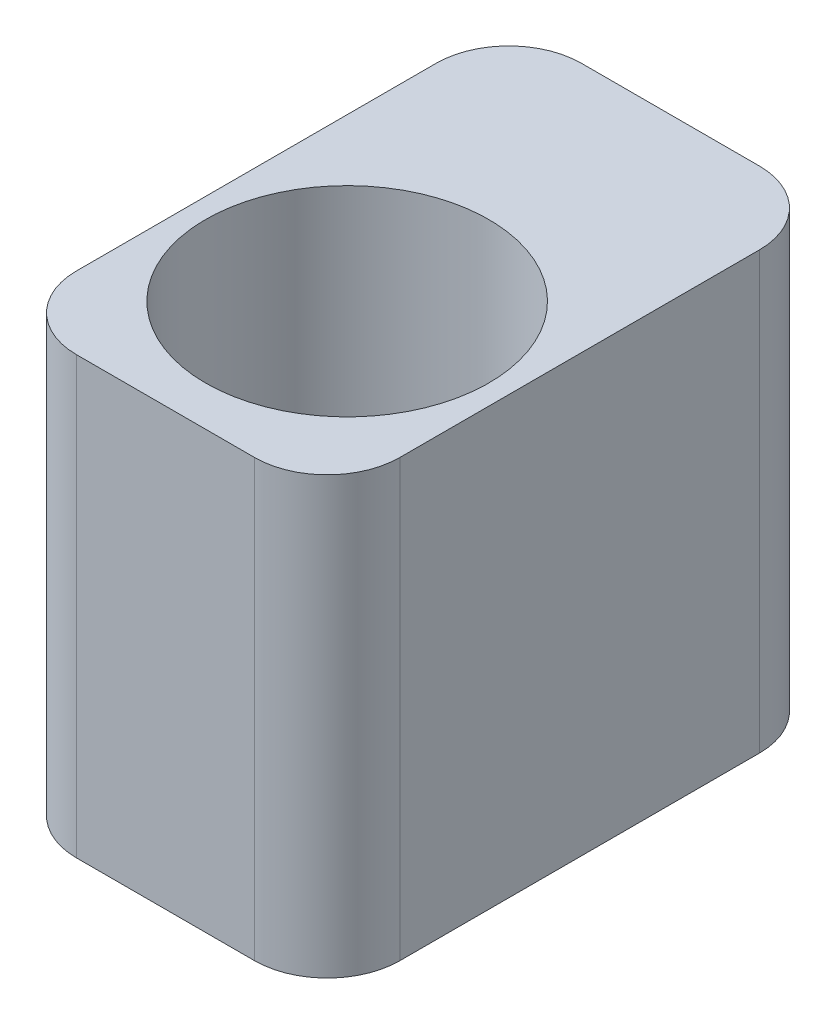
ISO-10303-21;
HEADER;
FILE_DESCRIPTION(('STEP AP214'),'2;1');
FILE_NAME('part.step','',(''),(''),'','','');
FILE_SCHEMA(('AUTOMOTIVE_DESIGN { 1 0 10303 214 1 1 1 1 }'));
ENDSEC;
DATA;
#1=APPLICATION_CONTEXT('core data for automotive mechanical design processes');
#2=APPLICATION_PROTOCOL_DEFINITION('international standard','automotive_design',2000,#1);
#3=PRODUCT_CONTEXT('',#1,'mechanical');
#4=PRODUCT('Part','Part','',(#3));
#5=PRODUCT_RELATED_PRODUCT_CATEGORY('part','',(#4));
#6=PRODUCT_DEFINITION_FORMATION('','',#4);
#7=PRODUCT_DEFINITION_CONTEXT('part definition',#1,'design');
#8=PRODUCT_DEFINITION('design','',#6,#7);
#9=PRODUCT_DEFINITION_SHAPE('','',#8);
#10=(LENGTH_UNIT() NAMED_UNIT(*) SI_UNIT(.MILLI.,.METRE.));
#11=(NAMED_UNIT(*) PLANE_ANGLE_UNIT() SI_UNIT($,.RADIAN.));
#12=(NAMED_UNIT(*) SI_UNIT($,.STERADIAN.) SOLID_ANGLE_UNIT());
#13=UNCERTAINTY_MEASURE_WITH_UNIT(LENGTH_MEASURE(1.E-05),#10,'distance_accuracy_value','');
#14=(GEOMETRIC_REPRESENTATION_CONTEXT(3) GLOBAL_UNCERTAINTY_ASSIGNED_CONTEXT((#13)) GLOBAL_UNIT_ASSIGNED_CONTEXT((#10,
#11,#12)) REPRESENTATION_CONTEXT('',''));
#15=CARTESIAN_POINT('',(0.,0.,0.));
#16=DIRECTION('',(0.,0.,1.));
#17=DIRECTION('',(1.,0.,0.));
#18=AXIS2_PLACEMENT_3D('',#15,#16,#17);
#19=CARTESIAN_POINT('',(0.,60.,0.));
#20=DIRECTION('',(0.,1.,0.));
#21=DIRECTION('',(0.,0.,1.));
#22=AXIS2_PLACEMENT_3D('',#19,#20,#21);
#23=PLANE('',#22);
#24=DIRECTION('',(0.,0.,1.));
#25=VECTOR('',#24,1.);
#26=CARTESIAN_POINT('',(-22.25,60.,-22.25));
#27=LINE('',#26,#25);
#28=CARTESIAN_POINT('',(-22.25,60.,-12.25));
#29=VERTEX_POINT('',#28);
#30=CARTESIAN_POINT('',(-22.25,60.,37.25));
#31=VERTEX_POINT('',#30);
#32=EDGE_CURVE('E172',#29,#31,#27,.T.);
#33=ORIENTED_EDGE('',*,*,#32,.T.);
#34=CARTESIAN_POINT('',(-12.25,60.,37.25));
#35=DIRECTION('',(0.,1.,0.));
#36=DIRECTION('',(0.,0.,1.));
#37=AXIS2_PLACEMENT_3D('',#34,#35,#36);
#38=CIRCLE('',#37,10.);
#39=CARTESIAN_POINT('',(-12.25,60.,47.25));
#40=VERTEX_POINT('',#39);
#41=EDGE_CURVE('E149',#31,#40,#38,.T.);
#42=ORIENTED_EDGE('',*,*,#41,.T.);
#43=DIRECTION('',(1.,0.,0.));
#44=VECTOR('',#43,1.);
#45=CARTESIAN_POINT('',(-22.25,60.,47.25));
#46=LINE('',#45,#44);
#47=CARTESIAN_POINT('',(12.25,60.,47.25));
#48=VERTEX_POINT('',#47);
#49=EDGE_CURVE('E120',#40,#48,#46,.T.);
#50=ORIENTED_EDGE('',*,*,#49,.T.);
#51=CARTESIAN_POINT('',(12.25,60.,37.25));
#52=DIRECTION('',(0.,1.,0.));
#53=DIRECTION('',(0.,0.,1.));
#54=AXIS2_PLACEMENT_3D('',#51,#52,#53);
#55=CIRCLE('',#54,10.);
#56=CARTESIAN_POINT('',(22.25,60.,37.25));
#57=VERTEX_POINT('',#56);
#58=EDGE_CURVE('E147',#48,#57,#55,.T.);
#59=ORIENTED_EDGE('',*,*,#58,.T.);
#60=DIRECTION('',(0.,0.,-1.));
#61=VECTOR('',#60,1.);
#62=CARTESIAN_POINT('',(22.25,60.,22.25));
#63=LINE('',#62,#61);
#64=CARTESIAN_POINT('',(22.25,60.,-12.25));
#65=VERTEX_POINT('',#64);
#66=EDGE_CURVE('E127',#57,#65,#63,.T.);
#67=ORIENTED_EDGE('',*,*,#66,.T.);
#68=CARTESIAN_POINT('',(12.25,60.,-12.25));
#69=DIRECTION('',(0.,1.,0.));
#70=DIRECTION('',(0.,0.,1.));
#71=AXIS2_PLACEMENT_3D('',#68,#69,#70);
#72=CIRCLE('',#71,10.);
#73=CARTESIAN_POINT('',(12.25,60.,-22.25));
#74=VERTEX_POINT('',#73);
#75=EDGE_CURVE('E55',#65,#74,#72,.T.);
#76=ORIENTED_EDGE('',*,*,#75,.T.);
#77=DIRECTION('',(-1.,0.,0.));
#78=VECTOR('',#77,1.);
#79=CARTESIAN_POINT('',(-22.25,60.,-22.25));
#80=LINE('',#79,#78);
#81=CARTESIAN_POINT('',(-12.25,60.,-22.25));
#82=VERTEX_POINT('',#81);
#83=EDGE_CURVE('E130',#74,#82,#80,.T.);
#84=ORIENTED_EDGE('',*,*,#83,.T.);
#85=CARTESIAN_POINT('',(-12.25,60.,-12.25));
#86=DIRECTION('',(0.,1.,0.));
#87=DIRECTION('',(0.,0.,1.));
#88=AXIS2_PLACEMENT_3D('',#85,#86,#87);
#89=CIRCLE('',#88,10.);
#90=EDGE_CURVE('E144',#82,#29,#89,.T.);
#91=ORIENTED_EDGE('',*,*,#90,.T.);
#92=EDGE_LOOP('',(#33,#42,#50,#59,#67,#76,#84,#91));
#93=FACE_BOUND('',#92,.T.);
#94=CARTESIAN_POINT('',(0.,60.,22.25));
#95=DIRECTION('',(0.,1.,0.));
#96=DIRECTION('',(0.,0.,1.));
#97=AXIS2_PLACEMENT_3D('',#94,#95,#96);
#98=CIRCLE('',#97,19.5);
#99=CARTESIAN_POINT('',(0.,60.,41.75));
#100=VERTEX_POINT('',#99);
#101=EDGE_CURVE('E165',#100,#100,#98,.T.);
#102=ORIENTED_EDGE('',*,*,#101,.F.);
#103=EDGE_LOOP('',(#102));
#104=FACE_BOUND('',#103,.T.);
#105=ADVANCED_FACE('F34',(#93,#104),#23,.T.);
#106=CARTESIAN_POINT('',(0.,0.,0.));
#107=DIRECTION('',(0.,1.,0.));
#108=DIRECTION('',(0.,0.,1.));
#109=AXIS2_PLACEMENT_3D('',#106,#107,#108);
#110=PLANE('',#109);
#111=DIRECTION('',(1.,0.,0.));
#112=VECTOR('',#111,1.);
#113=CARTESIAN_POINT('',(-22.25,0.,47.25));
#114=LINE('',#113,#112);
#115=CARTESIAN_POINT('',(-12.25,0.,47.25));
#116=VERTEX_POINT('',#115);
#117=CARTESIAN_POINT('',(12.25,0.,47.25));
#118=VERTEX_POINT('',#117);
#119=EDGE_CURVE('E117',#116,#118,#114,.T.);
#120=ORIENTED_EDGE('',*,*,#119,.F.);
#121=CARTESIAN_POINT('',(-12.25,0.,37.25));
#122=DIRECTION('',(0.,1.,0.));
#123=DIRECTION('',(0.,0.,1.));
#124=AXIS2_PLACEMENT_3D('',#121,#122,#123);
#125=CIRCLE('',#124,10.);
#126=CARTESIAN_POINT('',(-22.25,0.,37.25));
#127=VERTEX_POINT('',#126);
#128=EDGE_CURVE('E100',#116,#127,#125,.F.);
#129=ORIENTED_EDGE('',*,*,#128,.T.);
#130=DIRECTION('',(0.,0.,1.));
#131=VECTOR('',#130,1.);
#132=CARTESIAN_POINT('',(-22.25,0.,22.25));
#133=LINE('',#132,#131);
#134=CARTESIAN_POINT('',(-22.25,0.,-12.25));
#135=VERTEX_POINT('',#134);
#136=EDGE_CURVE('E128',#135,#127,#133,.T.);
#137=ORIENTED_EDGE('',*,*,#136,.F.);
#138=CARTESIAN_POINT('',(-12.25,0.,-12.25));
#139=DIRECTION('',(0.,1.,0.));
#140=DIRECTION('',(0.,0.,1.));
#141=AXIS2_PLACEMENT_3D('',#138,#139,#140);
#142=CIRCLE('',#141,10.);
#143=CARTESIAN_POINT('',(-12.25,0.,-22.25));
#144=VERTEX_POINT('',#143);
#145=EDGE_CURVE('E121',#135,#144,#142,.F.);
#146=ORIENTED_EDGE('',*,*,#145,.T.);
#147=DIRECTION('',(-1.,0.,0.));
#148=VECTOR('',#147,1.);
#149=CARTESIAN_POINT('',(-22.25,0.,-22.25));
#150=LINE('',#149,#148);
#151=CARTESIAN_POINT('',(12.25,0.,-22.25));
#152=VERTEX_POINT('',#151);
#153=EDGE_CURVE('E132',#152,#144,#150,.T.);
#154=ORIENTED_EDGE('',*,*,#153,.F.);
#155=CARTESIAN_POINT('',(12.25,0.,-12.25));
#156=DIRECTION('',(0.,1.,0.));
#157=DIRECTION('',(0.,0.,1.));
#158=AXIS2_PLACEMENT_3D('',#155,#156,#157);
#159=CIRCLE('',#158,10.);
#160=CARTESIAN_POINT('',(22.25,0.,-12.25));
#161=VERTEX_POINT('',#160);
#162=EDGE_CURVE('E138',#152,#161,#159,.F.);
#163=ORIENTED_EDGE('',*,*,#162,.T.);
#164=DIRECTION('',(0.,0.,-1.));
#165=VECTOR('',#164,1.);
#166=CARTESIAN_POINT('',(22.25,0.,-22.25));
#167=LINE('',#166,#165);
#168=CARTESIAN_POINT('',(22.25,0.,37.25));
#169=VERTEX_POINT('',#168);
#170=EDGE_CURVE('E160',#169,#161,#167,.T.);
#171=ORIENTED_EDGE('',*,*,#170,.F.);
#172=CARTESIAN_POINT('',(12.25,0.,37.25));
#173=DIRECTION('',(0.,1.,0.));
#174=DIRECTION('',(0.,0.,1.));
#175=AXIS2_PLACEMENT_3D('',#172,#173,#174);
#176=CIRCLE('',#175,10.);
#177=EDGE_CURVE('E111',#169,#118,#176,.F.);
#178=ORIENTED_EDGE('',*,*,#177,.T.);
#179=EDGE_LOOP('',(#120,#129,#137,#146,#154,#163,#171,#178));
#180=FACE_BOUND('',#179,.T.);
#181=CARTESIAN_POINT('',(0.,0.,22.25));
#182=DIRECTION('',(0.,1.,0.));
#183=DIRECTION('',(0.,0.,1.));
#184=AXIS2_PLACEMENT_3D('',#181,#182,#183);
#185=CIRCLE('',#184,19.5);
#186=CARTESIAN_POINT('',(0.,0.,41.75));
#187=VERTEX_POINT('',#186);
#188=EDGE_CURVE('E168',#187,#187,#185,.T.);
#189=ORIENTED_EDGE('',*,*,#188,.T.);
#190=EDGE_LOOP('',(#189));
#191=FACE_BOUND('',#190,.T.);
#192=ADVANCED_FACE('F124',(#180,#191),#110,.F.);
#193=CARTESIAN_POINT('',(22.25,60.,-22.25));
#194=DIRECTION('',(-1.,0.,0.));
#195=DIRECTION('',(0.,0.,1.));
#196=AXIS2_PLACEMENT_3D('',#193,#194,#195);
#197=PLANE('',#196);
#198=ORIENTED_EDGE('',*,*,#66,.F.);
#199=DIRECTION('',(0.,-1.,0.));
#200=VECTOR('',#199,1.);
#201=CARTESIAN_POINT('',(22.25,60.,37.25));
#202=LINE('',#201,#200);
#203=EDGE_CURVE('E153',#57,#169,#202,.T.);
#204=ORIENTED_EDGE('',*,*,#203,.T.);
#205=ORIENTED_EDGE('',*,*,#170,.T.);
#206=DIRECTION('',(0.,-1.,0.));
#207=VECTOR('',#206,1.);
#208=CARTESIAN_POINT('',(22.25,60.,-12.25));
#209=LINE('',#208,#207);
#210=EDGE_CURVE('E151',#161,#65,#209,.F.);
#211=ORIENTED_EDGE('',*,*,#210,.T.);
#212=EDGE_LOOP('',(#198,#204,#205,#211));
#213=FACE_BOUND('',#212,.T.);
#214=ADVANCED_FACE('F159',(#213),#197,.F.);
#215=CARTESIAN_POINT('',(-22.25,60.,-22.25));
#216=DIRECTION('',(0.,0.,1.));
#217=DIRECTION('',(1.,0.,0.));
#218=AXIS2_PLACEMENT_3D('',#215,#216,#217);
#219=PLANE('',#218);
#220=ORIENTED_EDGE('',*,*,#83,.F.);
#221=DIRECTION('',(0.,-1.,0.));
#222=VECTOR('',#221,1.);
#223=CARTESIAN_POINT('',(12.25,60.,-22.25));
#224=LINE('',#223,#222);
#225=EDGE_CURVE('E11',#74,#152,#224,.T.);
#226=ORIENTED_EDGE('',*,*,#225,.T.);
#227=ORIENTED_EDGE('',*,*,#153,.T.);
#228=DIRECTION('',(0.,-1.,0.));
#229=VECTOR('',#228,1.);
#230=CARTESIAN_POINT('',(-12.25,60.,-22.25));
#231=LINE('',#230,#229);
#232=EDGE_CURVE('E42',#144,#82,#231,.F.);
#233=ORIENTED_EDGE('',*,*,#232,.T.);
#234=EDGE_LOOP('',(#220,#226,#227,#233));
#235=FACE_BOUND('',#234,.T.);
#236=ADVANCED_FACE('F201',(#235),#219,.F.);
#237=CARTESIAN_POINT('',(-22.25,60.,22.25));
#238=DIRECTION('',(1.,0.,0.));
#239=DIRECTION('',(0.,0.,-1.));
#240=AXIS2_PLACEMENT_3D('',#237,#238,#239);
#241=PLANE('',#240);
#242=ORIENTED_EDGE('',*,*,#136,.T.);
#243=DIRECTION('',(0.,-1.,0.));
#244=VECTOR('',#243,1.);
#245=CARTESIAN_POINT('',(-22.25,60.,37.25));
#246=LINE('',#245,#244);
#247=EDGE_CURVE('E105',#127,#31,#246,.F.);
#248=ORIENTED_EDGE('',*,*,#247,.T.);
#249=ORIENTED_EDGE('',*,*,#32,.F.);
#250=DIRECTION('',(0.,-1.,0.));
#251=VECTOR('',#250,1.);
#252=CARTESIAN_POINT('',(-22.25,60.,-12.25));
#253=LINE('',#252,#251);
#254=EDGE_CURVE('E110',#29,#135,#253,.T.);
#255=ORIENTED_EDGE('',*,*,#254,.T.);
#256=EDGE_LOOP('',(#242,#248,#249,#255));
#257=FACE_BOUND('',#256,.T.);
#258=ADVANCED_FACE('F189',(#257),#241,.F.);
#259=CARTESIAN_POINT('',(-22.25,60.,47.25));
#260=DIRECTION('',(0.,0.,-1.));
#261=DIRECTION('',(-1.,0.,0.));
#262=AXIS2_PLACEMENT_3D('',#259,#260,#261);
#263=PLANE('',#262);
#264=ORIENTED_EDGE('',*,*,#49,.F.);
#265=DIRECTION('',(0.,-1.,0.));
#266=VECTOR('',#265,1.);
#267=CARTESIAN_POINT('',(-12.25,60.,47.25));
#268=LINE('',#267,#266);
#269=EDGE_CURVE('E104',#40,#116,#268,.T.);
#270=ORIENTED_EDGE('',*,*,#269,.T.);
#271=ORIENTED_EDGE('',*,*,#119,.T.);
#272=DIRECTION('',(0.,-1.,0.));
#273=VECTOR('',#272,1.);
#274=CARTESIAN_POINT('',(12.25,60.,47.25));
#275=LINE('',#274,#273);
#276=EDGE_CURVE('E122',#118,#48,#275,.F.);
#277=ORIENTED_EDGE('',*,*,#276,.T.);
#278=EDGE_LOOP('',(#264,#270,#271,#277));
#279=FACE_BOUND('',#278,.T.);
#280=ADVANCED_FACE('F116',(#279),#263,.F.);
#281=CARTESIAN_POINT('',(0.,60.,22.25));
#282=DIRECTION('',(0.,-1.,0.));
#283=DIRECTION('',(0.,0.,-1.));
#284=AXIS2_PLACEMENT_3D('',#281,#282,#283);
#285=CYLINDRICAL_SURFACE('',#284,19.5);
#286=ORIENTED_EDGE('',*,*,#101,.T.);
#287=EDGE_LOOP('',(#286));
#288=FACE_BOUND('',#287,.T.);
#289=ORIENTED_EDGE('',*,*,#188,.F.);
#290=EDGE_LOOP('',(#289));
#291=FACE_BOUND('',#290,.T.);
#292=ADVANCED_FACE('F179',(#288,#291),#285,.F.);
#293=CARTESIAN_POINT('',(-12.25,60.,37.25));
#294=DIRECTION('',(0.,-1.,0.));
#295=DIRECTION('',(0.,0.,-1.));
#296=AXIS2_PLACEMENT_3D('',#293,#294,#295);
#297=CYLINDRICAL_SURFACE('',#296,10.);
#298=ORIENTED_EDGE('',*,*,#41,.F.);
#299=ORIENTED_EDGE('',*,*,#247,.F.);
#300=ORIENTED_EDGE('',*,*,#128,.F.);
#301=ORIENTED_EDGE('',*,*,#269,.F.);
#302=EDGE_LOOP('',(#298,#299,#300,#301));
#303=FACE_BOUND('',#302,.T.);
#304=ADVANCED_FACE('F103',(#303),#297,.T.);
#305=CARTESIAN_POINT('',(12.25,60.,37.25));
#306=DIRECTION('',(0.,-1.,0.));
#307=DIRECTION('',(0.,0.,-1.));
#308=AXIS2_PLACEMENT_3D('',#305,#306,#307);
#309=CYLINDRICAL_SURFACE('',#308,10.);
#310=ORIENTED_EDGE('',*,*,#58,.F.);
#311=ORIENTED_EDGE('',*,*,#276,.F.);
#312=ORIENTED_EDGE('',*,*,#177,.F.);
#313=ORIENTED_EDGE('',*,*,#203,.F.);
#314=EDGE_LOOP('',(#310,#311,#312,#313));
#315=FACE_BOUND('',#314,.T.);
#316=ADVANCED_FACE('F187',(#315),#309,.T.);
#317=CARTESIAN_POINT('',(12.25,60.,-12.25));
#318=DIRECTION('',(0.,-1.,0.));
#319=DIRECTION('',(0.,0.,-1.));
#320=AXIS2_PLACEMENT_3D('',#317,#318,#319);
#321=CYLINDRICAL_SURFACE('',#320,10.);
#322=ORIENTED_EDGE('',*,*,#75,.F.);
#323=ORIENTED_EDGE('',*,*,#210,.F.);
#324=ORIENTED_EDGE('',*,*,#162,.F.);
#325=ORIENTED_EDGE('',*,*,#225,.F.);
#326=EDGE_LOOP('',(#322,#323,#324,#325));
#327=FACE_BOUND('',#326,.T.);
#328=ADVANCED_FACE('F208',(#327),#321,.T.);
#329=CARTESIAN_POINT('',(-12.25,60.,-12.25));
#330=DIRECTION('',(0.,-1.,0.));
#331=DIRECTION('',(0.,0.,-1.));
#332=AXIS2_PLACEMENT_3D('',#329,#330,#331);
#333=CYLINDRICAL_SURFACE('',#332,10.);
#334=ORIENTED_EDGE('',*,*,#90,.F.);
#335=ORIENTED_EDGE('',*,*,#232,.F.);
#336=ORIENTED_EDGE('',*,*,#145,.F.);
#337=ORIENTED_EDGE('',*,*,#254,.F.);
#338=EDGE_LOOP('',(#334,#335,#336,#337));
#339=FACE_BOUND('',#338,.T.);
#340=ADVANCED_FACE('F36',(#339),#333,.T.);
#341=CLOSED_SHELL('',(#105,#192,#214,#236,#258,#280,#292,#304,#316,#328,#340));
#342=MANIFOLD_SOLID_BREP('B2',#341);
#343=ADVANCED_BREP_SHAPE_REPRESENTATION('',(#18,#342),#14);
#344=SHAPE_DEFINITION_REPRESENTATION(#9,#343);
ENDSEC;
END-ISO-10303-21;
